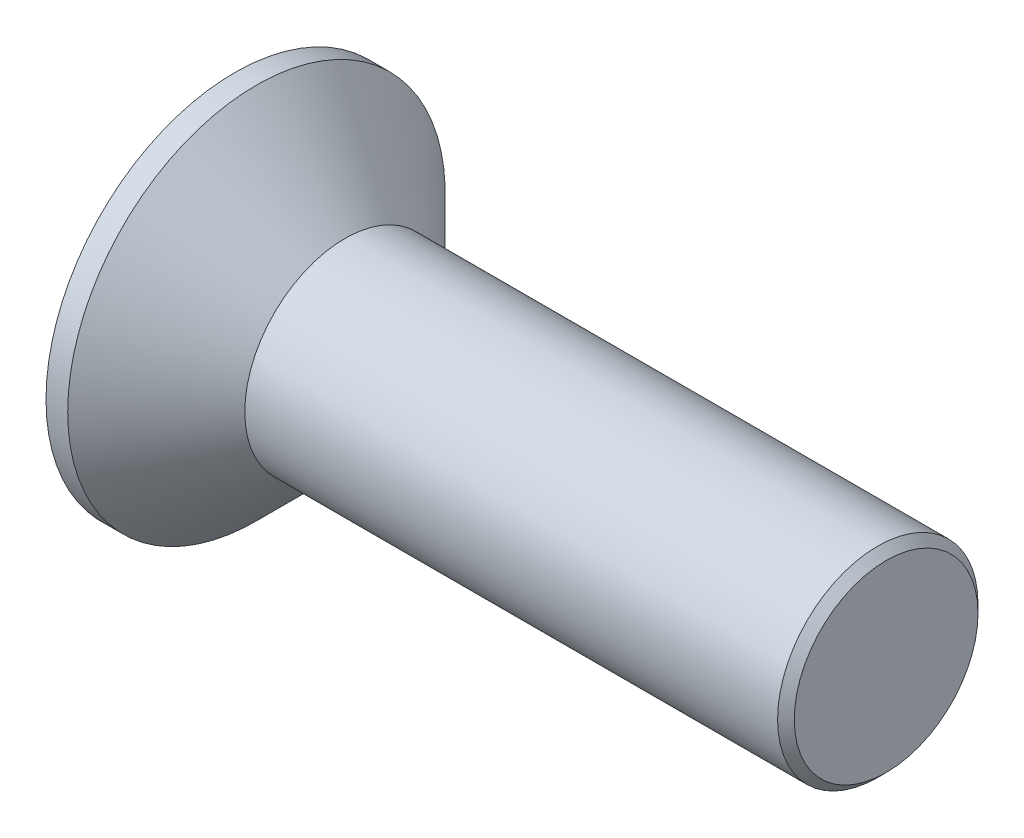
ISO-10303-21;
HEADER;
FILE_DESCRIPTION(('STEP AP214'),'2;1');
FILE_NAME('part.step','',(''),(''),'','','');
FILE_SCHEMA(('AUTOMOTIVE_DESIGN { 1 0 10303 214 1 1 1 1 }'));
ENDSEC;
DATA;
#1=APPLICATION_CONTEXT('core data for automotive mechanical design processes');
#2=APPLICATION_PROTOCOL_DEFINITION('international standard','automotive_design',2000,#1);
#3=PRODUCT_CONTEXT('',#1,'mechanical');
#4=PRODUCT('Part','Part','',(#3));
#5=PRODUCT_RELATED_PRODUCT_CATEGORY('part','',(#4));
#6=PRODUCT_DEFINITION_FORMATION('','',#4);
#7=PRODUCT_DEFINITION_CONTEXT('part definition',#1,'design');
#8=PRODUCT_DEFINITION('design','',#6,#7);
#9=PRODUCT_DEFINITION_SHAPE('','',#8);
#10=(LENGTH_UNIT() NAMED_UNIT(*) SI_UNIT(.MILLI.,.METRE.));
#11=(NAMED_UNIT(*) PLANE_ANGLE_UNIT() SI_UNIT($,.RADIAN.));
#12=(NAMED_UNIT(*) SI_UNIT($,.STERADIAN.) SOLID_ANGLE_UNIT());
#13=UNCERTAINTY_MEASURE_WITH_UNIT(LENGTH_MEASURE(1.E-05),#10,'distance_accuracy_value','');
#14=(GEOMETRIC_REPRESENTATION_CONTEXT(3) GLOBAL_UNCERTAINTY_ASSIGNED_CONTEXT((#13)) GLOBAL_UNIT_ASSIGNED_CONTEXT((#10,
#11,#12)) REPRESENTATION_CONTEXT('',''));
#15=CARTESIAN_POINT('',(0.,0.,0.));
#16=DIRECTION('',(0.,0.,1.));
#17=DIRECTION('',(1.,0.,0.));
#18=AXIS2_PLACEMENT_3D('',#15,#16,#17);
#19=CARTESIAN_POINT('',(0.,0.,0.));
#20=DIRECTION('',(-1.,0.,0.));
#21=DIRECTION('',(0.,0.,1.));
#22=AXIS2_PLACEMENT_3D('',#19,#20,#21);
#23=PLANE('',#22);
#24=DIRECTION('',(0.,-0.5,0.866025403784439));
#25=VECTOR('',#24,1.);
#26=CARTESIAN_POINT('',(0.,-1.5,-2.59807621135332));
#27=LINE('',#26,#25);
#28=CARTESIAN_POINT('',(0.,-1.5,-2.59807621135332));
#29=VERTEX_POINT('',#28);
#30=CARTESIAN_POINT('',(0.,-3.,0.));
#31=VERTEX_POINT('',#30);
#32=EDGE_CURVE('E50',#29,#31,#27,.T.);
#33=ORIENTED_EDGE('',*,*,#32,.F.);
#34=DIRECTION('',(0.,-1.,0.));
#35=VECTOR('',#34,1.);
#36=CARTESIAN_POINT('',(0.,1.5,-2.59807621135332));
#37=LINE('',#36,#35);
#38=CARTESIAN_POINT('',(0.,1.5,-2.59807621135332));
#39=VERTEX_POINT('',#38);
#40=EDGE_CURVE('E133',#39,#29,#37,.T.);
#41=ORIENTED_EDGE('',*,*,#40,.F.);
#42=DIRECTION('',(0.,-0.5,-0.866025403784439));
#43=VECTOR('',#42,1.);
#44=CARTESIAN_POINT('',(0.,3.,0.));
#45=LINE('',#44,#43);
#46=CARTESIAN_POINT('',(0.,3.,0.));
#47=VERTEX_POINT('',#46);
#48=EDGE_CURVE('E131',#47,#39,#45,.T.);
#49=ORIENTED_EDGE('',*,*,#48,.F.);
#50=DIRECTION('',(0.,0.5,-0.866025403784439));
#51=VECTOR('',#50,1.);
#52=CARTESIAN_POINT('',(0.,1.5,2.59807621135332));
#53=LINE('',#52,#51);
#54=CARTESIAN_POINT('',(0.,1.5,2.59807621135332));
#55=VERTEX_POINT('',#54);
#56=EDGE_CURVE('E98',#55,#47,#53,.T.);
#57=ORIENTED_EDGE('',*,*,#56,.F.);
#58=DIRECTION('',(0.,1.,0.));
#59=VECTOR('',#58,1.);
#60=CARTESIAN_POINT('',(0.,-1.5,2.59807621135332));
#61=LINE('',#60,#59);
#62=CARTESIAN_POINT('',(0.,-1.5,2.59807621135332));
#63=VERTEX_POINT('',#62);
#64=EDGE_CURVE('E127',#63,#55,#61,.T.);
#65=ORIENTED_EDGE('',*,*,#64,.F.);
#66=DIRECTION('',(0.,0.5,0.866025403784439));
#67=VECTOR('',#66,1.);
#68=CARTESIAN_POINT('',(0.,-3.,0.));
#69=LINE('',#68,#67);
#70=EDGE_CURVE('E124',#31,#63,#69,.T.);
#71=ORIENTED_EDGE('',*,*,#70,.F.);
#72=EDGE_LOOP('',(#33,#41,#49,#57,#65,#71));
#73=FACE_BOUND('',#72,.T.);
#74=CARTESIAN_POINT('',(0.,0.,0.));
#75=DIRECTION('',(-1.,0.,0.));
#76=DIRECTION('',(0.,0.,1.));
#77=AXIS2_PLACEMENT_3D('',#74,#75,#76);
#78=CIRCLE('',#77,5.65);
#79=CARTESIAN_POINT('',(0.,0.,5.65));
#80=VERTEX_POINT('',#79);
#81=EDGE_CURVE('E148',#80,#80,#78,.T.);
#82=ORIENTED_EDGE('',*,*,#81,.T.);
#83=EDGE_LOOP('',(#82));
#84=FACE_BOUND('',#83,.T.);
#85=ADVANCED_FACE('F35',(#73,#84),#23,.T.);
#86=CARTESIAN_POINT('',(-6.34999999999999,0.,0.));
#87=DIRECTION('',(-1.,0.,0.));
#88=DIRECTION('',(0.,0.,1.));
#89=AXIS2_PLACEMENT_3D('',#86,#87,#88);
#90=CYLINDRICAL_SURFACE('',#89,5.65);
#91=CARTESIAN_POINT('',(0.65000000000001,0.,0.));
#92=DIRECTION('',(-1.,0.,0.));
#93=DIRECTION('',(0.,0.,1.));
#94=AXIS2_PLACEMENT_3D('',#91,#92,#93);
#95=CIRCLE('',#94,5.65);
#96=CARTESIAN_POINT('',(0.65000000000001,0.,5.65));
#97=VERTEX_POINT('',#96);
#98=EDGE_CURVE('E145',#97,#97,#95,.T.);
#99=ORIENTED_EDGE('',*,*,#98,.T.);
#100=EDGE_LOOP('',(#99));
#101=FACE_BOUND('',#100,.T.);
#102=ORIENTED_EDGE('',*,*,#81,.F.);
#103=EDGE_LOOP('',(#102));
#104=FACE_BOUND('',#103,.T.);
#105=ADVANCED_FACE('F165',(#101,#104),#90,.T.);
#106=CARTESIAN_POINT('',(0.65000000000001,0.,0.));
#107=DIRECTION('',(-1.,0.,0.));
#108=DIRECTION('',(0.,0.,1.));
#109=AXIS2_PLACEMENT_3D('',#106,#107,#108);
#110=CONICAL_SURFACE('',#109,5.65,0.78539816339745);
#111=CARTESIAN_POINT('',(3.3,0.,0.));
#112=DIRECTION('',(-1.,0.,0.));
#113=DIRECTION('',(0.,0.,1.));
#114=AXIS2_PLACEMENT_3D('',#111,#112,#113);
#115=CIRCLE('',#114,3.);
#116=CARTESIAN_POINT('',(3.3,0.,3.));
#117=VERTEX_POINT('',#116);
#118=EDGE_CURVE('E137',#117,#117,#115,.T.);
#119=ORIENTED_EDGE('',*,*,#118,.T.);
#120=EDGE_LOOP('',(#119));
#121=FACE_BOUND('',#120,.T.);
#122=ORIENTED_EDGE('',*,*,#98,.F.);
#123=EDGE_LOOP('',(#122));
#124=FACE_BOUND('',#123,.T.);
#125=ADVANCED_FACE('F170',(#121,#124),#110,.T.);
#126=CARTESIAN_POINT('',(-6.34999999999999,0.,0.));
#127=DIRECTION('',(-1.,0.,0.));
#128=DIRECTION('',(0.,0.,1.));
#129=AXIS2_PLACEMENT_3D('',#126,#127,#128);
#130=CYLINDRICAL_SURFACE('',#129,3.);
#131=CARTESIAN_POINT('',(19.25,0.,0.));
#132=DIRECTION('',(1.,0.,0.));
#133=DIRECTION('',(0.,0.,-1.));
#134=AXIS2_PLACEMENT_3D('',#131,#132,#133);
#135=CIRCLE('',#134,3.);
#136=CARTESIAN_POINT('',(19.25,0.,-3.));
#137=VERTEX_POINT('',#136);
#138=EDGE_CURVE('E43',#137,#137,#135,.F.);
#139=ORIENTED_EDGE('',*,*,#138,.T.);
#140=EDGE_LOOP('',(#139));
#141=FACE_BOUND('',#140,.T.);
#142=ORIENTED_EDGE('',*,*,#118,.F.);
#143=EDGE_LOOP('',(#142));
#144=FACE_BOUND('',#143,.T.);
#145=ADVANCED_FACE('F153',(#141,#144),#130,.T.);
#146=CARTESIAN_POINT('',(19.5,3.,0.));
#147=DIRECTION('',(1.,0.,0.));
#148=DIRECTION('',(0.,0.,-1.));
#149=AXIS2_PLACEMENT_3D('',#146,#147,#148);
#150=PLANE('',#149);
#151=CARTESIAN_POINT('',(19.5,0.,0.));
#152=DIRECTION('',(1.,0.,0.));
#153=DIRECTION('',(0.,0.,-1.));
#154=AXIS2_PLACEMENT_3D('',#151,#152,#153);
#155=CIRCLE('',#154,2.75);
#156=CARTESIAN_POINT('',(19.5,0.,-2.75));
#157=VERTEX_POINT('',#156);
#158=EDGE_CURVE('E11',#157,#157,#155,.T.);
#159=ORIENTED_EDGE('',*,*,#158,.T.);
#160=EDGE_LOOP('',(#159));
#161=FACE_BOUND('',#160,.T.);
#162=ADVANCED_FACE('F180',(#161),#150,.T.);
#163=CARTESIAN_POINT('',(2.,-1.5,-2.59807621135332));
#164=DIRECTION('',(0.,-0.866025403784439,-0.5));
#165=DIRECTION('',(0.,0.5,-0.866025403784439));
#166=AXIS2_PLACEMENT_3D('',#163,#164,#165);
#167=PLANE('',#166);
#168=ORIENTED_EDGE('',*,*,#32,.T.);
#169=DIRECTION('',(-1.,0.,0.));
#170=VECTOR('',#169,1.);
#171=CARTESIAN_POINT('',(2.,-3.,0.));
#172=LINE('',#171,#170);
#173=CARTESIAN_POINT('',(2.,-3.,0.));
#174=VERTEX_POINT('',#173);
#175=EDGE_CURVE('E80',#174,#31,#172,.T.);
#176=ORIENTED_EDGE('',*,*,#175,.F.);
#177=DIRECTION('',(0.,-0.5,0.866025403784439));
#178=VECTOR('',#177,1.);
#179=CARTESIAN_POINT('',(2.,-1.5,-2.59807621135332));
#180=LINE('',#179,#178);
#181=CARTESIAN_POINT('',(2.,-1.5,-2.59807621135332));
#182=VERTEX_POINT('',#181);
#183=EDGE_CURVE('E135',#182,#174,#180,.T.);
#184=ORIENTED_EDGE('',*,*,#183,.F.);
#185=DIRECTION('',(-1.,0.,0.));
#186=VECTOR('',#185,1.);
#187=CARTESIAN_POINT('',(2.,-1.5,-2.59807621135332));
#188=LINE('',#187,#186);
#189=EDGE_CURVE('E58',#182,#29,#188,.T.);
#190=ORIENTED_EDGE('',*,*,#189,.T.);
#191=EDGE_LOOP('',(#168,#176,#184,#190));
#192=FACE_BOUND('',#191,.T.);
#193=ADVANCED_FACE('F183',(#192),#167,.F.);
#194=CARTESIAN_POINT('',(2.,1.5,-2.59807621135332));
#195=DIRECTION('',(0.,0.,-1.));
#196=DIRECTION('',(-1.,0.,0.));
#197=AXIS2_PLACEMENT_3D('',#194,#195,#196);
#198=PLANE('',#197);
#199=ORIENTED_EDGE('',*,*,#40,.T.);
#200=ORIENTED_EDGE('',*,*,#189,.F.);
#201=DIRECTION('',(0.,-1.,0.));
#202=VECTOR('',#201,1.);
#203=CARTESIAN_POINT('',(2.,1.5,-2.59807621135332));
#204=LINE('',#203,#202);
#205=CARTESIAN_POINT('',(2.,1.5,-2.59807621135332));
#206=VERTEX_POINT('',#205);
#207=EDGE_CURVE('E110',#206,#182,#204,.T.);
#208=ORIENTED_EDGE('',*,*,#207,.F.);
#209=DIRECTION('',(-1.,0.,0.));
#210=VECTOR('',#209,1.);
#211=CARTESIAN_POINT('',(2.,1.5,-2.59807621135332));
#212=LINE('',#211,#210);
#213=EDGE_CURVE('E102',#206,#39,#212,.T.);
#214=ORIENTED_EDGE('',*,*,#213,.T.);
#215=EDGE_LOOP('',(#199,#200,#208,#214));
#216=FACE_BOUND('',#215,.T.);
#217=ADVANCED_FACE('F187',(#216),#198,.F.);
#218=CARTESIAN_POINT('',(2.,3.,0.));
#219=DIRECTION('',(0.,0.866025403784439,-0.5));
#220=DIRECTION('',(0.,0.5,0.866025403784439));
#221=AXIS2_PLACEMENT_3D('',#218,#219,#220);
#222=PLANE('',#221);
#223=ORIENTED_EDGE('',*,*,#48,.T.);
#224=ORIENTED_EDGE('',*,*,#213,.F.);
#225=DIRECTION('',(0.,-0.5,-0.866025403784439));
#226=VECTOR('',#225,1.);
#227=CARTESIAN_POINT('',(2.,3.,0.));
#228=LINE('',#227,#226);
#229=CARTESIAN_POINT('',(2.,3.,0.));
#230=VERTEX_POINT('',#229);
#231=EDGE_CURVE('E106',#230,#206,#228,.T.);
#232=ORIENTED_EDGE('',*,*,#231,.F.);
#233=DIRECTION('',(-1.,0.,0.));
#234=VECTOR('',#233,1.);
#235=CARTESIAN_POINT('',(2.,3.,0.));
#236=LINE('',#235,#234);
#237=EDGE_CURVE('E91',#230,#47,#236,.T.);
#238=ORIENTED_EDGE('',*,*,#237,.T.);
#239=EDGE_LOOP('',(#223,#224,#232,#238));
#240=FACE_BOUND('',#239,.T.);
#241=ADVANCED_FACE('F107',(#240),#222,.F.);
#242=CARTESIAN_POINT('',(2.,1.5,2.59807621135332));
#243=DIRECTION('',(0.,0.866025403784439,0.5));
#244=DIRECTION('',(0.,-0.5,0.866025403784439));
#245=AXIS2_PLACEMENT_3D('',#242,#243,#244);
#246=PLANE('',#245);
#247=ORIENTED_EDGE('',*,*,#56,.T.);
#248=ORIENTED_EDGE('',*,*,#237,.F.);
#249=DIRECTION('',(0.,0.5,-0.866025403784439));
#250=VECTOR('',#249,1.);
#251=CARTESIAN_POINT('',(2.,1.5,2.59807621135332));
#252=LINE('',#251,#250);
#253=CARTESIAN_POINT('',(2.,1.5,2.59807621135332));
#254=VERTEX_POINT('',#253);
#255=EDGE_CURVE('E95',#254,#230,#252,.T.);
#256=ORIENTED_EDGE('',*,*,#255,.F.);
#257=DIRECTION('',(-1.,0.,0.));
#258=VECTOR('',#257,1.);
#259=CARTESIAN_POINT('',(2.,1.5,2.59807621135332));
#260=LINE('',#259,#258);
#261=EDGE_CURVE('E103',#254,#55,#260,.T.);
#262=ORIENTED_EDGE('',*,*,#261,.T.);
#263=EDGE_LOOP('',(#247,#248,#256,#262));
#264=FACE_BOUND('',#263,.T.);
#265=ADVANCED_FACE('F93',(#264),#246,.F.);
#266=CARTESIAN_POINT('',(2.,-1.5,2.59807621135332));
#267=DIRECTION('',(0.,0.,1.));
#268=DIRECTION('',(1.,0.,0.));
#269=AXIS2_PLACEMENT_3D('',#266,#267,#268);
#270=PLANE('',#269);
#271=ORIENTED_EDGE('',*,*,#64,.T.);
#272=ORIENTED_EDGE('',*,*,#261,.F.);
#273=DIRECTION('',(0.,1.,0.));
#274=VECTOR('',#273,1.);
#275=CARTESIAN_POINT('',(2.,-1.5,2.59807621135332));
#276=LINE('',#275,#274);
#277=CARTESIAN_POINT('',(2.,-1.5,2.59807621135332));
#278=VERTEX_POINT('',#277);
#279=EDGE_CURVE('E116',#278,#254,#276,.T.);
#280=ORIENTED_EDGE('',*,*,#279,.F.);
#281=DIRECTION('',(-1.,0.,0.));
#282=VECTOR('',#281,1.);
#283=CARTESIAN_POINT('',(2.,-1.5,2.59807621135332));
#284=LINE('',#283,#282);
#285=EDGE_CURVE('E140',#278,#63,#284,.T.);
#286=ORIENTED_EDGE('',*,*,#285,.T.);
#287=EDGE_LOOP('',(#271,#272,#280,#286));
#288=FACE_BOUND('',#287,.T.);
#289=ADVANCED_FACE('F190',(#288),#270,.F.);
#290=CARTESIAN_POINT('',(2.,-3.,0.));
#291=DIRECTION('',(0.,-0.866025403784439,0.5));
#292=DIRECTION('',(0.,-0.5,-0.866025403784439));
#293=AXIS2_PLACEMENT_3D('',#290,#291,#292);
#294=PLANE('',#293);
#295=ORIENTED_EDGE('',*,*,#70,.T.);
#296=ORIENTED_EDGE('',*,*,#285,.F.);
#297=DIRECTION('',(0.,0.5,0.866025403784439));
#298=VECTOR('',#297,1.);
#299=CARTESIAN_POINT('',(2.,-3.,0.));
#300=LINE('',#299,#298);
#301=EDGE_CURVE('E118',#174,#278,#300,.T.);
#302=ORIENTED_EDGE('',*,*,#301,.F.);
#303=ORIENTED_EDGE('',*,*,#175,.T.);
#304=EDGE_LOOP('',(#295,#296,#302,#303));
#305=FACE_BOUND('',#304,.T.);
#306=ADVANCED_FACE('F161',(#305),#294,.F.);
#307=CARTESIAN_POINT('',(2.,-4.5,2.59807621135332));
#308=DIRECTION('',(-1.,0.,0.));
#309=DIRECTION('',(0.,0.,1.));
#310=AXIS2_PLACEMENT_3D('',#307,#308,#309);
#311=PLANE('',#310);
#312=ORIENTED_EDGE('',*,*,#183,.T.);
#313=ORIENTED_EDGE('',*,*,#301,.T.);
#314=ORIENTED_EDGE('',*,*,#279,.T.);
#315=ORIENTED_EDGE('',*,*,#255,.T.);
#316=ORIENTED_EDGE('',*,*,#231,.T.);
#317=ORIENTED_EDGE('',*,*,#207,.T.);
#318=EDGE_LOOP('',(#312,#313,#314,#315,#316,#317));
#319=FACE_BOUND('',#318,.T.);
#320=ADVANCED_FACE('F113',(#319),#311,.T.);
#321=CARTESIAN_POINT('',(19.25,0.,0.));
#322=DIRECTION('',(-1.,0.,0.));
#323=DIRECTION('',(0.,0.,1.));
#324=AXIS2_PLACEMENT_3D('',#321,#322,#323);
#325=CONICAL_SURFACE('',#324,3.,0.785398163397447);
#326=ORIENTED_EDGE('',*,*,#158,.F.);
#327=EDGE_LOOP('',(#326));
#328=FACE_BOUND('',#327,.T.);
#329=ORIENTED_EDGE('',*,*,#138,.F.);
#330=EDGE_LOOP('',(#329));
#331=FACE_BOUND('',#330,.T.);
#332=ADVANCED_FACE('F37',(#328,#331),#325,.T.);
#333=CLOSED_SHELL('',(#85,#105,#125,#145,#162,#193,#217,#241,#265,#289,#306,#320,#332));
#334=MANIFOLD_SOLID_BREP('B2',#333);
#335=ADVANCED_BREP_SHAPE_REPRESENTATION('',(#18,#334),#14);
#336=SHAPE_DEFINITION_REPRESENTATION(#9,#335);
ENDSEC;
END-ISO-10303-21;
